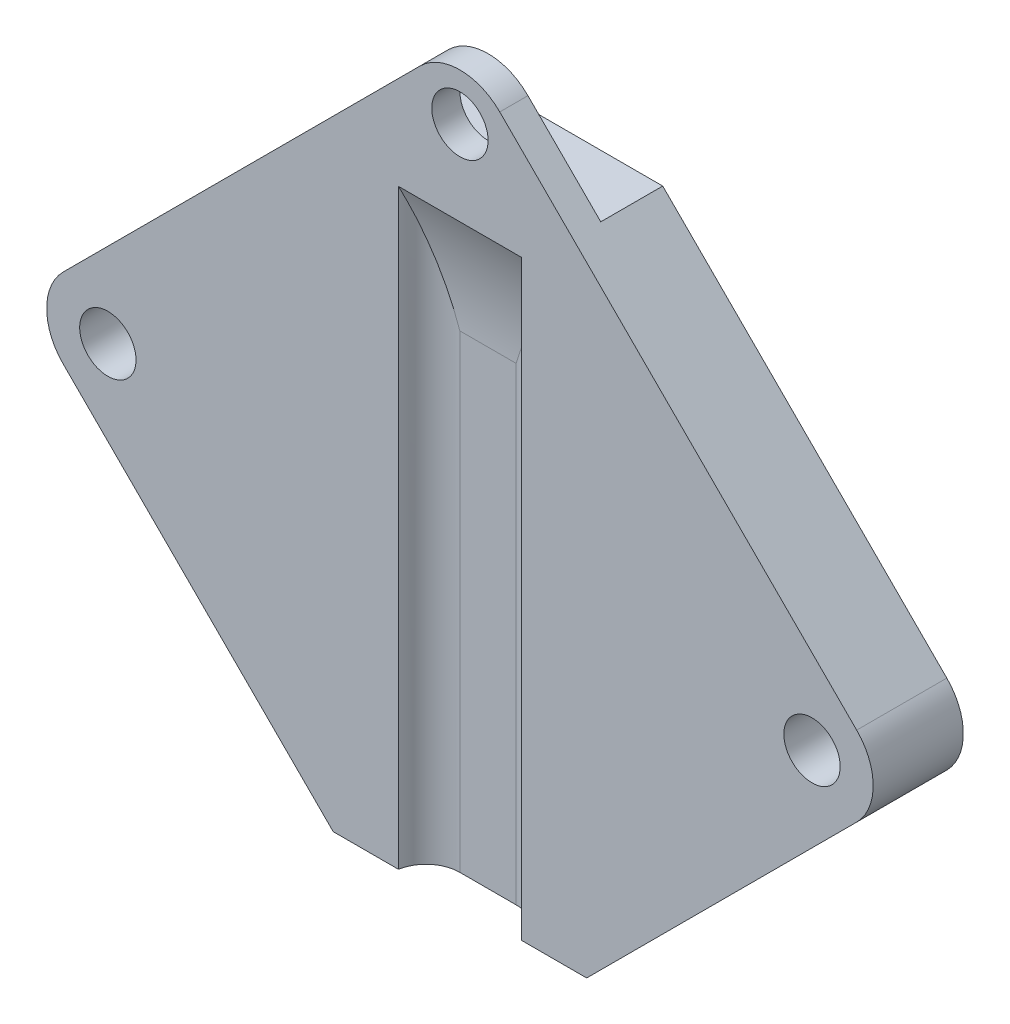
ISO-10303-21;
HEADER;
FILE_DESCRIPTION(('STEP AP214'),'2;1');
FILE_NAME('part.step','',(''),(''),'','','');
FILE_SCHEMA(('AUTOMOTIVE_DESIGN { 1 0 10303 214 1 1 1 1 }'));
ENDSEC;
DATA;
#1=APPLICATION_CONTEXT('core data for automotive mechanical design processes');
#2=APPLICATION_PROTOCOL_DEFINITION('international standard','automotive_design',2000,#1);
#3=PRODUCT_CONTEXT('',#1,'mechanical');
#4=PRODUCT('Part','Part','',(#3));
#5=PRODUCT_RELATED_PRODUCT_CATEGORY('part','',(#4));
#6=PRODUCT_DEFINITION_FORMATION('','',#4);
#7=PRODUCT_DEFINITION_CONTEXT('part definition',#1,'design');
#8=PRODUCT_DEFINITION('design','',#6,#7);
#9=PRODUCT_DEFINITION_SHAPE('','',#8);
#10=(LENGTH_UNIT() NAMED_UNIT(*) SI_UNIT(.MILLI.,.METRE.));
#11=(NAMED_UNIT(*) PLANE_ANGLE_UNIT() SI_UNIT($,.RADIAN.));
#12=(NAMED_UNIT(*) SI_UNIT($,.STERADIAN.) SOLID_ANGLE_UNIT());
#13=UNCERTAINTY_MEASURE_WITH_UNIT(LENGTH_MEASURE(1.E-05),#10,'distance_accuracy_value','');
#14=(GEOMETRIC_REPRESENTATION_CONTEXT(3) GLOBAL_UNCERTAINTY_ASSIGNED_CONTEXT((#13)) GLOBAL_UNIT_ASSIGNED_CONTEXT((#10,
#11,#12)) REPRESENTATION_CONTEXT('',''));
#15=CARTESIAN_POINT('',(0.,0.,0.));
#16=DIRECTION('',(0.,0.,1.));
#17=DIRECTION('',(1.,0.,0.));
#18=AXIS2_PLACEMENT_3D('',#15,#16,#17);
#19=CARTESIAN_POINT('',(-12.1235452370463,-1.24743454438484,3.2));
#20=DIRECTION('',(0.,0.,1.));
#21=DIRECTION('',(1.,0.,0.));
#22=AXIS2_PLACEMENT_3D('',#19,#20,#21);
#23=PLANE('',#22);
#24=DIRECTION('',(0.,-1.,0.));
#25=VECTOR('',#24,1.);
#26=CARTESIAN_POINT('',(-1.634521265384,8.75256545561517,3.2));
#27=LINE('',#26,#25);
#28=CARTESIAN_POINT('',(-1.634521265384,8.75256545561517,3.2));
#29=VERTEX_POINT('',#28);
#30=CARTESIAN_POINT('',(-1.634521265384,-12.2474345443848,3.2));
#31=VERTEX_POINT('',#30);
#32=EDGE_CURVE('E330',#29,#31,#27,.T.);
#33=ORIENTED_EDGE('',*,*,#32,.F.);
#34=DIRECTION('',(1.,0.,0.));
#35=VECTOR('',#34,1.);
#36=CARTESIAN_POINT('',(-12.1235452370463,8.75256545561517,3.2));
#37=LINE('',#36,#35);
#38=CARTESIAN_POINT('',(2.73057654179912,8.75256545561517,3.2));
#39=VERTEX_POINT('',#38);
#40=EDGE_CURVE('E197',#29,#39,#37,.T.);
#41=ORIENTED_EDGE('',*,*,#40,.T.);
#42=DIRECTION('',(0.,-1.,0.));
#43=VECTOR('',#42,1.);
#44=CARTESIAN_POINT('',(2.73057654179912,8.75256545561517,3.2));
#45=LINE('',#44,#43);
#46=CARTESIAN_POINT('',(2.73057654179912,-12.2474345443848,3.2));
#47=VERTEX_POINT('',#46);
#48=EDGE_CURVE('E321',#47,#39,#45,.F.);
#49=ORIENTED_EDGE('',*,*,#48,.F.);
#50=DIRECTION('',(1.,0.,0.));
#51=VECTOR('',#50,1.);
#52=CARTESIAN_POINT('',(-3.95197236179244,-12.2474345443848,3.2));
#53=LINE('',#52,#51);
#54=CARTESIAN_POINT('',(5.04802763820756,-12.2474345443848,3.2));
#55=VERTEX_POINT('',#54);
#56=EDGE_CURVE('E313',#47,#55,#53,.T.);
#57=ORIENTED_EDGE('',*,*,#56,.T.);
#58=DIRECTION('',(0.707106781186547,0.707106781186547,0.));
#59=VECTOR('',#58,1.);
#60=CARTESIAN_POINT('',(5.04802763820756,-12.2474345443848,3.2));
#61=LINE('',#60,#59);
#62=CARTESIAN_POINT('',(14.6338140758345,-2.66164810675793,3.2));
#63=VERTEX_POINT('',#62);
#64=EDGE_CURVE('E298',#55,#63,#61,.T.);
#65=ORIENTED_EDGE('',*,*,#64,.T.);
#66=CARTESIAN_POINT('',(13.2196005134614,-1.24743454438484,3.2));
#67=DIRECTION('',(0.,0.,1.));
#68=DIRECTION('',(1.,0.,0.));
#69=AXIS2_PLACEMENT_3D('',#66,#67,#68);
#70=CIRCLE('',#69,2.);
#71=CARTESIAN_POINT('',(14.6338140758345,0.166779017988258,3.2));
#72=VERTEX_POINT('',#71);
#73=EDGE_CURVE('E296',#63,#72,#70,.T.);
#74=ORIENTED_EDGE('',*,*,#73,.T.);
#75=DIRECTION('',(-0.707106781186548,0.707106781186548,0.));
#76=VECTOR('',#75,1.);
#77=CARTESIAN_POINT('',(14.6338140758345,0.166779017988258,3.2));
#78=LINE('',#77,#76);
#79=CARTESIAN_POINT('',(1.96224120058065,12.8383518932421,3.2));
#80=VERTEX_POINT('',#79);
#81=EDGE_CURVE('E297',#72,#80,#78,.T.);
#82=ORIENTED_EDGE('',*,*,#81,.T.);
#83=CARTESIAN_POINT('',(0.548027638207556,11.424138330869,3.2));
#84=DIRECTION('',(0.,0.,1.));
#85=DIRECTION('',(1.,0.,0.));
#86=AXIS2_PLACEMENT_3D('',#83,#84,#85);
#87=CIRCLE('',#86,2.);
#88=CARTESIAN_POINT('',(-0.866185924165539,12.8383518932421,3.2));
#89=VERTEX_POINT('',#88);
#90=EDGE_CURVE('E300',#80,#89,#87,.T.);
#91=ORIENTED_EDGE('',*,*,#90,.T.);
#92=DIRECTION('',(-0.707106781186548,-0.707106781186548,0.));
#93=VECTOR('',#92,1.);
#94=CARTESIAN_POINT('',(-0.866185924165539,12.8383518932421,3.2));
#95=LINE('',#94,#93);
#96=CARTESIAN_POINT('',(-13.5377587994193,0.166779017988258,3.2));
#97=VERTEX_POINT('',#96);
#98=EDGE_CURVE('E175',#89,#97,#95,.T.);
#99=ORIENTED_EDGE('',*,*,#98,.T.);
#100=CARTESIAN_POINT('',(-12.1235452370463,-1.24743454438484,3.2));
#101=DIRECTION('',(0.,0.,1.));
#102=DIRECTION('',(1.,0.,0.));
#103=AXIS2_PLACEMENT_3D('',#100,#101,#102);
#104=CIRCLE('',#103,2.);
#105=CARTESIAN_POINT('',(-13.5377587994193,-2.66164810675793,3.2));
#106=VERTEX_POINT('',#105);
#107=EDGE_CURVE('E165',#97,#106,#104,.T.);
#108=ORIENTED_EDGE('',*,*,#107,.T.);
#109=DIRECTION('',(0.707106781186548,-0.707106781186548,0.));
#110=VECTOR('',#109,1.);
#111=CARTESIAN_POINT('',(-13.5377587994193,-2.66164810675793,3.2));
#112=LINE('',#111,#110);
#113=CARTESIAN_POINT('',(-3.95197236179244,-12.2474345443848,3.2));
#114=VERTEX_POINT('',#113);
#115=EDGE_CURVE('E311',#106,#114,#112,.T.);
#116=ORIENTED_EDGE('',*,*,#115,.T.);
#117=EDGE_CURVE('E302',#114,#31,#53,.T.);
#118=ORIENTED_EDGE('',*,*,#117,.T.);
#119=EDGE_LOOP('',(#33,#41,#49,#57,#65,#74,#82,#91,#99,#108,#116,#118));
#120=FACE_BOUND('',#119,.T.);
#121=CARTESIAN_POINT('',(13.0480276382076,-1.24743454438484,3.2));
#122=DIRECTION('',(0.,0.,1.));
#123=DIRECTION('',(1.,0.,0.));
#124=AXIS2_PLACEMENT_3D('',#121,#122,#123);
#125=CIRCLE('',#124,1.);
#126=CARTESIAN_POINT('',(14.0480276382076,-1.24743454438484,3.2));
#127=VERTEX_POINT('',#126);
#128=EDGE_CURVE('E341',#127,#127,#125,.T.);
#129=ORIENTED_EDGE('',*,*,#128,.F.);
#130=EDGE_LOOP('',(#129));
#131=FACE_BOUND('',#130,.T.);
#132=CARTESIAN_POINT('',(-11.9519723617924,-1.24743454438484,3.2));
#133=DIRECTION('',(0.,0.,1.));
#134=DIRECTION('',(1.,0.,0.));
#135=AXIS2_PLACEMENT_3D('',#132,#133,#134);
#136=CIRCLE('',#135,1.);
#137=CARTESIAN_POINT('',(-10.9519723617924,-1.24743454438484,3.2));
#138=VERTEX_POINT('',#137);
#139=EDGE_CURVE('E280',#138,#138,#136,.T.);
#140=ORIENTED_EDGE('',*,*,#139,.F.);
#141=EDGE_LOOP('',(#140));
#142=FACE_BOUND('',#141,.T.);
#143=CARTESIAN_POINT('',(0.548027638207556,11.7525654556152,3.2));
#144=DIRECTION('',(0.,0.,1.));
#145=DIRECTION('',(1.,0.,0.));
#146=AXIS2_PLACEMENT_3D('',#143,#144,#145);
#147=CIRCLE('',#146,1.);
#148=CARTESIAN_POINT('',(1.54802763820756,11.7525654556152,3.2));
#149=VERTEX_POINT('',#148);
#150=EDGE_CURVE('E332',#149,#149,#147,.T.);
#151=ORIENTED_EDGE('',*,*,#150,.F.);
#152=EDGE_LOOP('',(#151));
#153=FACE_BOUND('',#152,.T.);
#154=ADVANCED_FACE('F37',(#120,#131,#142,#153),#23,.T.);
#155=CARTESIAN_POINT('',(-12.1235452370463,-1.24743454438484,0.));
#156=DIRECTION('',(0.,0.,1.));
#157=DIRECTION('',(1.,0.,0.));
#158=AXIS2_PLACEMENT_3D('',#155,#156,#157);
#159=PLANE('',#158);
#160=DIRECTION('',(-0.707106781186548,-0.707106781186548,0.));
#161=VECTOR('',#160,1.);
#162=CARTESIAN_POINT('',(-0.866185924165539,12.8383518932421,0.));
#163=LINE('',#162,#161);
#164=CARTESIAN_POINT('',(-3.45197236179244,10.2525654556152,0.));
#165=VERTEX_POINT('',#164);
#166=CARTESIAN_POINT('',(-13.5377587994193,0.166779017988258,0.));
#167=VERTEX_POINT('',#166);
#168=EDGE_CURVE('E155',#165,#167,#163,.T.);
#169=ORIENTED_EDGE('',*,*,#168,.F.);
#170=DIRECTION('',(-1.,0.,0.));
#171=VECTOR('',#170,1.);
#172=CARTESIAN_POINT('',(4.54802763820756,10.2525654556152,0.));
#173=LINE('',#172,#171);
#174=CARTESIAN_POINT('',(4.54802763820756,10.2525654556152,0.));
#175=VERTEX_POINT('',#174);
#176=EDGE_CURVE('E54',#175,#165,#173,.T.);
#177=ORIENTED_EDGE('',*,*,#176,.F.);
#178=DIRECTION('',(-0.707106781186548,0.707106781186548,0.));
#179=VECTOR('',#178,1.);
#180=CARTESIAN_POINT('',(14.6338140758345,0.166779017988258,0.));
#181=LINE('',#180,#179);
#182=CARTESIAN_POINT('',(14.6338140758345,0.166779017988258,0.));
#183=VERTEX_POINT('',#182);
#184=EDGE_CURVE('E153',#183,#175,#181,.T.);
#185=ORIENTED_EDGE('',*,*,#184,.F.);
#186=CARTESIAN_POINT('',(13.2196005134614,-1.24743454438484,0.));
#187=DIRECTION('',(0.,0.,1.));
#188=DIRECTION('',(1.,0.,0.));
#189=AXIS2_PLACEMENT_3D('',#186,#187,#188);
#190=CIRCLE('',#189,2.);
#191=CARTESIAN_POINT('',(14.6338140758345,-2.66164810675793,0.));
#192=VERTEX_POINT('',#191);
#193=EDGE_CURVE('E163',#192,#183,#190,.T.);
#194=ORIENTED_EDGE('',*,*,#193,.F.);
#195=DIRECTION('',(0.707106781186547,0.707106781186547,0.));
#196=VECTOR('',#195,1.);
#197=CARTESIAN_POINT('',(5.04802763820756,-12.2474345443848,0.));
#198=LINE('',#197,#196);
#199=CARTESIAN_POINT('',(5.04802763820756,-12.2474345443848,0.));
#200=VERTEX_POINT('',#199);
#201=EDGE_CURVE('E167',#200,#192,#198,.T.);
#202=ORIENTED_EDGE('',*,*,#201,.F.);
#203=DIRECTION('',(1.,0.,0.));
#204=VECTOR('',#203,1.);
#205=CARTESIAN_POINT('',(-3.95197236179244,-12.2474345443848,0.));
#206=LINE('',#205,#204);
#207=CARTESIAN_POINT('',(-3.95197236179244,-12.2474345443848,0.));
#208=VERTEX_POINT('',#207);
#209=EDGE_CURVE('E282',#208,#200,#206,.T.);
#210=ORIENTED_EDGE('',*,*,#209,.F.);
#211=DIRECTION('',(0.707106781186548,-0.707106781186548,0.));
#212=VECTOR('',#211,1.);
#213=CARTESIAN_POINT('',(-13.5377587994193,-2.66164810675793,0.));
#214=LINE('',#213,#212);
#215=CARTESIAN_POINT('',(-13.5377587994193,-2.66164810675793,0.));
#216=VERTEX_POINT('',#215);
#217=EDGE_CURVE('E279',#216,#208,#214,.T.);
#218=ORIENTED_EDGE('',*,*,#217,.F.);
#219=CARTESIAN_POINT('',(-12.1235452370463,-1.24743454438484,0.));
#220=DIRECTION('',(0.,0.,1.));
#221=DIRECTION('',(1.,0.,0.));
#222=AXIS2_PLACEMENT_3D('',#219,#220,#221);
#223=CIRCLE('',#222,2.);
#224=EDGE_CURVE('E276',#167,#216,#223,.T.);
#225=ORIENTED_EDGE('',*,*,#224,.F.);
#226=EDGE_LOOP('',(#169,#177,#185,#194,#202,#210,#218,#225));
#227=FACE_BOUND('',#226,.T.);
#228=CARTESIAN_POINT('',(-11.9519723617924,-1.24743454438484,0.));
#229=DIRECTION('',(0.,0.,1.));
#230=DIRECTION('',(1.,0.,0.));
#231=AXIS2_PLACEMENT_3D('',#228,#229,#230);
#232=CIRCLE('',#231,1.);
#233=CARTESIAN_POINT('',(-10.9519723617924,-1.24743454438484,0.));
#234=VERTEX_POINT('',#233);
#235=EDGE_CURVE('E285',#234,#234,#232,.T.);
#236=ORIENTED_EDGE('',*,*,#235,.T.);
#237=EDGE_LOOP('',(#236));
#238=FACE_BOUND('',#237,.T.);
#239=CARTESIAN_POINT('',(13.0480276382076,-1.24743454438484,0.));
#240=DIRECTION('',(0.,0.,1.));
#241=DIRECTION('',(1.,0.,0.));
#242=AXIS2_PLACEMENT_3D('',#239,#240,#241);
#243=CIRCLE('',#242,1.);
#244=CARTESIAN_POINT('',(14.0480276382076,-1.24743454438484,0.));
#245=VERTEX_POINT('',#244);
#246=EDGE_CURVE('E335',#245,#245,#243,.T.);
#247=ORIENTED_EDGE('',*,*,#246,.T.);
#248=EDGE_LOOP('',(#247));
#249=FACE_BOUND('',#248,.T.);
#250=ADVANCED_FACE('F150',(#227,#238,#249),#159,.F.);
#251=CARTESIAN_POINT('',(-12.1235452370463,-1.24743454438484,3.2));
#252=DIRECTION('',(0.,0.,-1.));
#253=DIRECTION('',(-1.,0.,0.));
#254=AXIS2_PLACEMENT_3D('',#251,#252,#253);
#255=CYLINDRICAL_SURFACE('',#254,2.);
#256=ORIENTED_EDGE('',*,*,#224,.T.);
#257=DIRECTION('',(0.,0.,-1.));
#258=VECTOR('',#257,1.);
#259=CARTESIAN_POINT('',(-13.5377587994193,-2.66164810675793,3.2));
#260=LINE('',#259,#258);
#261=EDGE_CURVE('E191',#106,#216,#260,.T.);
#262=ORIENTED_EDGE('',*,*,#261,.F.);
#263=ORIENTED_EDGE('',*,*,#107,.F.);
#264=DIRECTION('',(0.,0.,-1.));
#265=VECTOR('',#264,1.);
#266=CARTESIAN_POINT('',(-13.5377587994193,0.166779017988258,3.2));
#267=LINE('',#266,#265);
#268=EDGE_CURVE('E171',#97,#167,#267,.T.);
#269=ORIENTED_EDGE('',*,*,#268,.T.);
#270=EDGE_LOOP('',(#256,#262,#263,#269));
#271=FACE_BOUND('',#270,.T.);
#272=ADVANCED_FACE('F245',(#271),#255,.T.);
#273=CARTESIAN_POINT('',(-13.5377587994193,-2.66164810675793,3.2));
#274=DIRECTION('',(0.707106781186548,0.707106781186548,0.));
#275=DIRECTION('',(-0.707106781186548,0.707106781186548,0.));
#276=AXIS2_PLACEMENT_3D('',#273,#274,#275);
#277=PLANE('',#276);
#278=ORIENTED_EDGE('',*,*,#217,.T.);
#279=DIRECTION('',(0.,0.,-1.));
#280=VECTOR('',#279,1.);
#281=CARTESIAN_POINT('',(-3.95197236179244,-12.2474345443848,3.2));
#282=LINE('',#281,#280);
#283=EDGE_CURVE('E188',#114,#208,#282,.T.);
#284=ORIENTED_EDGE('',*,*,#283,.F.);
#285=ORIENTED_EDGE('',*,*,#115,.F.);
#286=ORIENTED_EDGE('',*,*,#261,.T.);
#287=EDGE_LOOP('',(#278,#284,#285,#286));
#288=FACE_BOUND('',#287,.T.);
#289=ADVANCED_FACE('F266',(#288),#277,.F.);
#290=CARTESIAN_POINT('',(-3.95197236179244,-12.2474345443848,3.2));
#291=DIRECTION('',(0.,1.,0.));
#292=DIRECTION('',(0.,0.,1.));
#293=AXIS2_PLACEMENT_3D('',#290,#291,#292);
#294=PLANE('',#293);
#295=DIRECTION('',(1.,0.,0.));
#296=VECTOR('',#295,1.);
#297=CARTESIAN_POINT('',(-0.451972361792444,-12.2474345443848,2.20390706366971));
#298=LINE('',#297,#296);
#299=CARTESIAN_POINT('',(-0.451972361792444,-12.2474345443848,2.20390706366971));
#300=VERTEX_POINT('',#299);
#301=CARTESIAN_POINT('',(1.54802763820756,-12.2474345443848,2.20390706366971));
#302=VERTEX_POINT('',#301);
#303=EDGE_CURVE('E327',#300,#302,#298,.T.);
#304=ORIENTED_EDGE('',*,*,#303,.F.);
#305=CARTESIAN_POINT('',(-0.451972361792444,-12.2474345443848,3.40390706366971));
#306=DIRECTION('',(0.,1.,0.));
#307=DIRECTION('',(0.,0.,1.));
#308=AXIS2_PLACEMENT_3D('',#305,#306,#307);
#309=CIRCLE('',#308,1.2);
#310=EDGE_CURVE('E194',#300,#31,#309,.T.);
#311=ORIENTED_EDGE('',*,*,#310,.T.);
#312=ORIENTED_EDGE('',*,*,#117,.F.);
#313=ORIENTED_EDGE('',*,*,#283,.T.);
#314=ORIENTED_EDGE('',*,*,#209,.T.);
#315=DIRECTION('',(0.,0.,-1.));
#316=VECTOR('',#315,1.);
#317=CARTESIAN_POINT('',(5.04802763820756,-12.2474345443848,3.2));
#318=LINE('',#317,#316);
#319=EDGE_CURVE('E185',#55,#200,#318,.T.);
#320=ORIENTED_EDGE('',*,*,#319,.F.);
#321=ORIENTED_EDGE('',*,*,#56,.F.);
#322=CARTESIAN_POINT('',(1.54802763820756,-12.2474345443848,3.40390706366971));
#323=DIRECTION('',(0.,-1.,0.));
#324=DIRECTION('',(0.,0.,-1.));
#325=AXIS2_PLACEMENT_3D('',#322,#323,#324);
#326=CIRCLE('',#325,1.2);
#327=EDGE_CURVE('E358',#302,#47,#326,.T.);
#328=ORIENTED_EDGE('',*,*,#327,.F.);
#329=EDGE_LOOP('',(#304,#311,#312,#313,#314,#320,#321,#328));
#330=FACE_BOUND('',#329,.T.);
#331=ADVANCED_FACE('F262',(#330),#294,.F.);
#332=CARTESIAN_POINT('',(5.04802763820756,-12.2474345443848,3.2));
#333=DIRECTION('',(-0.707106781186548,0.707106781186548,0.));
#334=DIRECTION('',(-0.707106781186548,-0.707106781186548,0.));
#335=AXIS2_PLACEMENT_3D('',#332,#333,#334);
#336=PLANE('',#335);
#337=ORIENTED_EDGE('',*,*,#201,.T.);
#338=DIRECTION('',(0.,0.,-1.));
#339=VECTOR('',#338,1.);
#340=CARTESIAN_POINT('',(14.6338140758345,-2.66164810675793,3.2));
#341=LINE('',#340,#339);
#342=EDGE_CURVE('E182',#63,#192,#341,.T.);
#343=ORIENTED_EDGE('',*,*,#342,.F.);
#344=ORIENTED_EDGE('',*,*,#64,.F.);
#345=ORIENTED_EDGE('',*,*,#319,.T.);
#346=EDGE_LOOP('',(#337,#343,#344,#345));
#347=FACE_BOUND('',#346,.T.);
#348=ADVANCED_FACE('F258',(#347),#336,.F.);
#349=CARTESIAN_POINT('',(13.2196005134614,-1.24743454438484,3.2));
#350=DIRECTION('',(0.,0.,-1.));
#351=DIRECTION('',(-1.,0.,0.));
#352=AXIS2_PLACEMENT_3D('',#349,#350,#351);
#353=CYLINDRICAL_SURFACE('',#352,2.);
#354=ORIENTED_EDGE('',*,*,#193,.T.);
#355=DIRECTION('',(0.,0.,-1.));
#356=VECTOR('',#355,1.);
#357=CARTESIAN_POINT('',(14.6338140758345,0.166779017988258,3.2));
#358=LINE('',#357,#356);
#359=EDGE_CURVE('E162',#72,#183,#358,.T.);
#360=ORIENTED_EDGE('',*,*,#359,.F.);
#361=ORIENTED_EDGE('',*,*,#73,.F.);
#362=ORIENTED_EDGE('',*,*,#342,.T.);
#363=EDGE_LOOP('',(#354,#360,#361,#362));
#364=FACE_BOUND('',#363,.T.);
#365=ADVANCED_FACE('F255',(#364),#353,.T.);
#366=CARTESIAN_POINT('',(14.6338140758345,0.166779017988258,3.2));
#367=DIRECTION('',(-0.707106781186548,-0.707106781186548,0.));
#368=DIRECTION('',(0.707106781186548,-0.707106781186548,0.));
#369=AXIS2_PLACEMENT_3D('',#366,#367,#368);
#370=PLANE('',#369);
#371=DIRECTION('',(0.,0.,-1.));
#372=VECTOR('',#371,1.);
#373=CARTESIAN_POINT('',(4.54802763820756,10.2525654556152,12.1442719099992));
#374=LINE('',#373,#372);
#375=CARTESIAN_POINT('',(4.54802763820756,10.2525654556152,2.2));
#376=VERTEX_POINT('',#375);
#377=EDGE_CURVE('E139',#376,#175,#374,.T.);
#378=ORIENTED_EDGE('',*,*,#377,.F.);
#379=DIRECTION('',(0.707106781186548,-0.707106781186548,0.));
#380=VECTOR('',#379,1.);
#381=CARTESIAN_POINT('',(4.54802763820756,10.2525654556152,2.2));
#382=LINE('',#381,#380);
#383=CARTESIAN_POINT('',(1.96224120058065,12.8383518932421,2.2));
#384=VERTEX_POINT('',#383);
#385=EDGE_CURVE('E145',#384,#376,#382,.T.);
#386=ORIENTED_EDGE('',*,*,#385,.F.);
#387=DIRECTION('',(0.,0.,-1.));
#388=VECTOR('',#387,1.);
#389=CARTESIAN_POINT('',(1.96224120058065,12.8383518932421,3.2));
#390=LINE('',#389,#388);
#391=EDGE_CURVE('E178',#80,#384,#390,.T.);
#392=ORIENTED_EDGE('',*,*,#391,.F.);
#393=ORIENTED_EDGE('',*,*,#81,.F.);
#394=ORIENTED_EDGE('',*,*,#359,.T.);
#395=ORIENTED_EDGE('',*,*,#184,.T.);
#396=EDGE_LOOP('',(#378,#386,#392,#393,#394,#395));
#397=FACE_BOUND('',#396,.T.);
#398=ADVANCED_FACE('F159',(#397),#370,.F.);
#399=CARTESIAN_POINT('',(0.548027638207556,11.424138330869,3.2));
#400=DIRECTION('',(0.,0.,-1.));
#401=DIRECTION('',(-1.,0.,0.));
#402=AXIS2_PLACEMENT_3D('',#399,#400,#401);
#403=CYLINDRICAL_SURFACE('',#402,2.);
#404=ORIENTED_EDGE('',*,*,#391,.T.);
#405=CARTESIAN_POINT('',(0.548027638207556,11.424138330869,2.2));
#406=DIRECTION('',(0.,0.,1.));
#407=DIRECTION('',(1.,0.,0.));
#408=AXIS2_PLACEMENT_3D('',#405,#406,#407);
#409=CIRCLE('',#408,2.);
#410=CARTESIAN_POINT('',(-0.866185924165539,12.8383518932421,2.2));
#411=VERTEX_POINT('',#410);
#412=EDGE_CURVE('E362',#384,#411,#409,.T.);
#413=ORIENTED_EDGE('',*,*,#412,.T.);
#414=DIRECTION('',(0.,0.,-1.));
#415=VECTOR('',#414,1.);
#416=CARTESIAN_POINT('',(-0.866185924165539,12.8383518932421,3.2));
#417=LINE('',#416,#415);
#418=EDGE_CURVE('E174',#89,#411,#417,.T.);
#419=ORIENTED_EDGE('',*,*,#418,.F.);
#420=ORIENTED_EDGE('',*,*,#90,.F.);
#421=EDGE_LOOP('',(#404,#413,#419,#420));
#422=FACE_BOUND('',#421,.T.);
#423=ADVANCED_FACE('F248',(#422),#403,.T.);
#424=CARTESIAN_POINT('',(-0.866185924165539,12.8383518932421,3.2));
#425=DIRECTION('',(0.707106781186548,-0.707106781186548,0.));
#426=DIRECTION('',(0.707106781186547,0.707106781186548,0.));
#427=AXIS2_PLACEMENT_3D('',#424,#425,#426);
#428=PLANE('',#427);
#429=ORIENTED_EDGE('',*,*,#418,.T.);
#430=DIRECTION('',(0.707106781186548,0.707106781186548,0.));
#431=VECTOR('',#430,1.);
#432=CARTESIAN_POINT('',(0.548027638207556,14.2525654556152,2.2));
#433=LINE('',#432,#431);
#434=CARTESIAN_POINT('',(-3.45197236179244,10.2525654556152,2.2));
#435=VERTEX_POINT('',#434);
#436=EDGE_CURVE('E156',#435,#411,#433,.T.);
#437=ORIENTED_EDGE('',*,*,#436,.F.);
#438=DIRECTION('',(0.,0.,-1.));
#439=VECTOR('',#438,1.);
#440=CARTESIAN_POINT('',(-3.45197236179244,10.2525654556152,12.1442719099992));
#441=LINE('',#440,#439);
#442=EDGE_CURVE('E365',#435,#165,#441,.T.);
#443=ORIENTED_EDGE('',*,*,#442,.T.);
#444=ORIENTED_EDGE('',*,*,#168,.T.);
#445=ORIENTED_EDGE('',*,*,#268,.F.);
#446=ORIENTED_EDGE('',*,*,#98,.F.);
#447=EDGE_LOOP('',(#429,#437,#443,#444,#445,#446));
#448=FACE_BOUND('',#447,.T.);
#449=ADVANCED_FACE('F238',(#448),#428,.F.);
#450=CARTESIAN_POINT('',(-11.9519723617924,-1.24743454438484,3.2));
#451=DIRECTION('',(0.,0.,-1.));
#452=DIRECTION('',(-1.,0.,0.));
#453=AXIS2_PLACEMENT_3D('',#450,#451,#452);
#454=CYLINDRICAL_SURFACE('',#453,1.);
#455=ORIENTED_EDGE('',*,*,#139,.T.);
#456=EDGE_LOOP('',(#455));
#457=FACE_BOUND('',#456,.T.);
#458=ORIENTED_EDGE('',*,*,#235,.F.);
#459=EDGE_LOOP('',(#458));
#460=FACE_BOUND('',#459,.T.);
#461=ADVANCED_FACE('F234',(#457,#460),#454,.F.);
#462=CARTESIAN_POINT('',(13.0480276382076,-1.24743454438484,3.2));
#463=DIRECTION('',(0.,0.,-1.));
#464=DIRECTION('',(-1.,0.,0.));
#465=AXIS2_PLACEMENT_3D('',#462,#463,#464);
#466=CYLINDRICAL_SURFACE('',#465,1.);
#467=ORIENTED_EDGE('',*,*,#128,.T.);
#468=EDGE_LOOP('',(#467));
#469=FACE_BOUND('',#468,.T.);
#470=ORIENTED_EDGE('',*,*,#246,.F.);
#471=EDGE_LOOP('',(#470));
#472=FACE_BOUND('',#471,.T.);
#473=ADVANCED_FACE('F230',(#469,#472),#466,.F.);
#474=CARTESIAN_POINT('',(0.548027638207556,11.7525654556152,3.2));
#475=DIRECTION('',(0.,0.,-1.));
#476=DIRECTION('',(-1.,0.,0.));
#477=AXIS2_PLACEMENT_3D('',#474,#475,#476);
#478=CYLINDRICAL_SURFACE('',#477,1.);
#479=CARTESIAN_POINT('',(0.548027638207556,11.7525654556152,2.2));
#480=DIRECTION('',(0.,0.,1.));
#481=DIRECTION('',(1.,0.,0.));
#482=AXIS2_PLACEMENT_3D('',#479,#480,#481);
#483=CIRCLE('',#482,1.);
#484=CARTESIAN_POINT('',(1.54802763820756,11.7525654556152,2.2));
#485=VERTEX_POINT('',#484);
#486=EDGE_CURVE('E42',#485,#485,#483,.T.);
#487=ORIENTED_EDGE('',*,*,#486,.F.);
#488=EDGE_LOOP('',(#487));
#489=FACE_BOUND('',#488,.T.);
#490=ORIENTED_EDGE('',*,*,#150,.T.);
#491=EDGE_LOOP('',(#490));
#492=FACE_BOUND('',#491,.T.);
#493=ADVANCED_FACE('F222',(#489,#492),#478,.F.);
#494=CARTESIAN_POINT('',(-0.451972361792444,8.75256545561517,3.40390706366971));
#495=DIRECTION('',(0.,-1.,0.));
#496=DIRECTION('',(0.,0.,-1.));
#497=AXIS2_PLACEMENT_3D('',#494,#495,#496);
#498=CYLINDRICAL_SURFACE('',#497,1.2);
#499=DIRECTION('',(0.,-1.,0.));
#500=VECTOR('',#499,1.);
#501=CARTESIAN_POINT('',(-0.451972361792444,8.75256545561517,2.20390706366971));
#502=LINE('',#501,#500);
#503=CARTESIAN_POINT('',(-0.451972361792444,4.40174282204358,2.20390706366971));
#504=VERTEX_POINT('',#503);
#505=EDGE_CURVE('E328',#504,#300,#502,.T.);
#506=ORIENTED_EDGE('',*,*,#505,.F.);
#507=CARTESIAN_POINT('',(-1.634521265384,8.75256545561517,3.2));
#508=CARTESIAN_POINT('',(-1.62742166854424,8.66753352133177,3.15890959047029));
#509=CARTESIAN_POINT('',(-1.61836685713988,8.58206895848201,3.1190992909149));
#510=CARTESIAN_POINT('',(-1.59682368385973,8.41044247975531,3.0420752403015));
#511=CARTESIAN_POINT('',(-1.58433664425129,8.32428084480729,3.00486049621283));
#512=CARTESIAN_POINT('',(-1.55642340567842,8.15150920365221,2.93309317841487));
#513=CARTESIAN_POINT('',(-1.54100223006989,8.06490020637132,2.89853619447813));
#514=CARTESIAN_POINT('',(-1.50758525001569,7.89118223329485,2.83200942056852));
#515=CARTESIAN_POINT('',(-1.48958915966445,7.80407320301048,2.8000399185146));
#516=CARTESIAN_POINT('',(-1.43239402505051,7.54278279988989,2.70823100518636));
#517=CARTESIAN_POINT('',(-1.38987459836444,7.36796806652128,2.65221361250332));
#518=CARTESIAN_POINT('',(-1.29812085445788,7.01712661622551,2.55024603847703));
#519=CARTESIAN_POINT('',(-1.24888327719699,6.84109935052721,2.50430077311035));
#520=CARTESIAN_POINT('',(-1.14262982250453,6.47876325030847,2.42012473149362));
#521=CARTESIAN_POINT('',(-1.0853386548961,6.29240846356877,2.38243859705619));
#522=CARTESIAN_POINT('',(-0.966838082836076,5.91906461350071,2.31787387045225));
#523=CARTESIAN_POINT('',(-0.905627428473529,5.73207536602897,2.29099874597698));
#524=CARTESIAN_POINT('',(-0.718290589109998,5.17065996766195,2.22640230921254));
#525=CARTESIAN_POINT('',(-0.588356540865859,4.79545204665018,2.20463303629294));
#526=CARTESIAN_POINT('',(-0.456336671420218,4.4143415278263,2.20391301940083));
#527=CARTESIAN_POINT('',(-0.454154490704055,4.40804211545445,2.2039070673601));
#528=CARTESIAN_POINT('',(-0.451972361792444,4.40174282204358,2.2039070636697));
#529=B_SPLINE_CURVE_WITH_KNOTS('',3,(#507,#508,#509,#510,#511,#512,#513,#514,#515,#516,#517,
#518,#519,#520,#521,#522,#523,#524,#525,#526,#527,#528),.UNSPECIFIED.,.F.,.F.,(4,2,2,2,2,2,2,2,
2,2,4),(0.,0.284058860323902,0.568008439866837,0.851476191050468,1.13497544152665,
1.69977715062909,2.26485391587896,2.86018062018945,3.45569812686292,4.64566458840564,
4.66566459637763),.UNSPECIFIED.);
#530=EDGE_CURVE('E12',#504,#29,#529,.F.);
#531=ORIENTED_EDGE('',*,*,#530,.T.);
#532=ORIENTED_EDGE('',*,*,#32,.T.);
#533=ORIENTED_EDGE('',*,*,#310,.F.);
#534=EDGE_LOOP('',(#506,#531,#532,#533));
#535=FACE_BOUND('',#534,.T.);
#536=ADVANCED_FACE('F213',(#535),#498,.F.);
#537=CARTESIAN_POINT('',(1.54802763820756,8.75256545561517,3.40390706366971));
#538=DIRECTION('',(0.,-1.,0.));
#539=DIRECTION('',(0.,0.,-1.));
#540=AXIS2_PLACEMENT_3D('',#537,#538,#539);
#541=CYLINDRICAL_SURFACE('',#540,1.2);
#542=ORIENTED_EDGE('',*,*,#48,.T.);
#543=CARTESIAN_POINT('',(2.73057654179912,8.75256545561517,3.2));
#544=CARTESIAN_POINT('',(2.72347694495935,8.66753352133174,3.15890959047028));
#545=CARTESIAN_POINT('',(2.71442213355499,8.58206895848197,3.11909929091488));
#546=CARTESIAN_POINT('',(2.69287896027483,8.41044247975523,3.04207524030147));
#547=CARTESIAN_POINT('',(2.68039192066638,8.32428084480719,3.00486049621279));
#548=CARTESIAN_POINT('',(2.65247868209351,8.15150920365207,2.93309317841482));
#549=CARTESIAN_POINT('',(2.63705750648498,8.06490020637117,2.89853619447807));
#550=CARTESIAN_POINT('',(2.60364052643077,7.89118223329467,2.83200942056845));
#551=CARTESIAN_POINT('',(2.58564443607952,7.80407320301028,2.80003991851453));
#552=CARTESIAN_POINT('',(2.52844930146558,7.54278279988971,2.7082310051863));
#553=CARTESIAN_POINT('',(2.48592987477951,7.36796806652113,2.65221361250327));
#554=CARTESIAN_POINT('',(2.39417613087297,7.01712661622544,2.55024603847701));
#555=CARTESIAN_POINT('',(2.3449385536121,6.84109935052717,2.50430077311035));
#556=CARTESIAN_POINT('',(2.23868509891963,6.47876325030848,2.42012473149362));
#557=CARTESIAN_POINT('',(2.18139393131116,6.2924084635688,2.38243859705619));
#558=CARTESIAN_POINT('',(2.06289335925124,5.91906461350071,2.31787387045226));
#559=CARTESIAN_POINT('',(2.00168270488884,5.73207536602893,2.29099874597699));
#560=CARTESIAN_POINT('',(1.81434586552473,5.17065996766211,2.22640230921254));
#561=CARTESIAN_POINT('',(1.68441181727886,4.79545204665093,2.20463303629292));
#562=CARTESIAN_POINT('',(1.55239194783526,4.41434152782633,2.20391301940083));
#563=CARTESIAN_POINT('',(1.55020976711913,4.40804211545446,2.2039070673601));
#564=CARTESIAN_POINT('',(1.54802763820756,4.40174282204358,2.20390706366971));
#565=B_SPLINE_CURVE_WITH_KNOTS('',3,(#543,#544,#545,#546,#547,#548,#549,#550,#551,#552,#553,
#554,#555,#556,#557,#558,#559,#560,#561,#562,#563,#564),.UNSPECIFIED.,.F.,.F.,(4,2,2,2,2,2,2,2,
2,2,4),(0.,0.284058860323968,0.568008439866968,0.851476191050651,1.13497544152689,
1.6997771506292,2.26485391587896,2.86018062018944,3.45569812686289,4.64566458840563,
4.66566459637763),.UNSPECIFIED.);
#566=CARTESIAN_POINT('',(1.54802763820756,4.40174282204358,2.20390706366971));
#567=VERTEX_POINT('',#566);
#568=EDGE_CURVE('E200',#39,#567,#565,.T.);
#569=ORIENTED_EDGE('',*,*,#568,.T.);
#570=DIRECTION('',(0.,-1.,0.));
#571=VECTOR('',#570,1.);
#572=CARTESIAN_POINT('',(1.54802763820756,8.75256545561517,2.20390706366971));
#573=LINE('',#572,#571);
#574=EDGE_CURVE('E337',#567,#302,#573,.T.);
#575=ORIENTED_EDGE('',*,*,#574,.T.);
#576=ORIENTED_EDGE('',*,*,#327,.T.);
#577=EDGE_LOOP('',(#542,#569,#575,#576));
#578=FACE_BOUND('',#577,.T.);
#579=ADVANCED_FACE('F207',(#578),#541,.F.);
#580=CARTESIAN_POINT('',(-0.451972361792444,8.75256545561517,2.20390706366971));
#581=DIRECTION('',(0.,0.,-1.));
#582=DIRECTION('',(-1.,0.,0.));
#583=AXIS2_PLACEMENT_3D('',#580,#581,#582);
#584=PLANE('',#583);
#585=ORIENTED_EDGE('',*,*,#574,.F.);
#586=DIRECTION('',(-1.,0.,0.));
#587=VECTOR('',#586,1.);
#588=CARTESIAN_POINT('',(-0.451972361792444,4.40174282204358,2.20390706366971));
#589=LINE('',#588,#587);
#590=EDGE_CURVE('E47',#567,#504,#589,.T.);
#591=ORIENTED_EDGE('',*,*,#590,.T.);
#592=ORIENTED_EDGE('',*,*,#505,.T.);
#593=ORIENTED_EDGE('',*,*,#303,.T.);
#594=EDGE_LOOP('',(#585,#591,#592,#593));
#595=FACE_BOUND('',#594,.T.);
#596=ADVANCED_FACE('F212',(#595),#584,.F.);
#597=CARTESIAN_POINT('',(-0.451972361792446,4.40174282204358,12.2039070636697));
#598=DIRECTION('',(-1.,0.,0.));
#599=DIRECTION('',(0.,0.,1.));
#600=AXIS2_PLACEMENT_3D('',#597,#598,#599);
#601=CYLINDRICAL_SURFACE('',#600,10.);
#602=ORIENTED_EDGE('',*,*,#530,.F.);
#603=ORIENTED_EDGE('',*,*,#590,.F.);
#604=ORIENTED_EDGE('',*,*,#568,.F.);
#605=ORIENTED_EDGE('',*,*,#40,.F.);
#606=EDGE_LOOP('',(#602,#603,#604,#605));
#607=FACE_BOUND('',#606,.T.);
#608=ADVANCED_FACE('F39',(#607),#601,.F.);
#609=CARTESIAN_POINT('',(-12.1235452370463,-1.24743454438484,2.2));
#610=DIRECTION('',(0.,0.,1.));
#611=DIRECTION('',(1.,0.,0.));
#612=AXIS2_PLACEMENT_3D('',#609,#610,#611);
#613=PLANE('',#612);
#614=ORIENTED_EDGE('',*,*,#486,.T.);
#615=EDGE_LOOP('',(#614));
#616=FACE_BOUND('',#615,.T.);
#617=ORIENTED_EDGE('',*,*,#385,.T.);
#618=DIRECTION('',(-1.,0.,0.));
#619=VECTOR('',#618,1.);
#620=CARTESIAN_POINT('',(4.54802763820756,10.2525654556152,2.2));
#621=LINE('',#620,#619);
#622=EDGE_CURVE('E141',#376,#435,#621,.T.);
#623=ORIENTED_EDGE('',*,*,#622,.T.);
#624=ORIENTED_EDGE('',*,*,#436,.T.);
#625=ORIENTED_EDGE('',*,*,#412,.F.);
#626=EDGE_LOOP('',(#617,#623,#624,#625));
#627=FACE_BOUND('',#626,.T.);
#628=ADVANCED_FACE('F215',(#616,#627),#613,.F.);
#629=CARTESIAN_POINT('',(4.54802763820756,10.2525654556152,12.1442719099992));
#630=DIRECTION('',(0.,-1.,0.));
#631=DIRECTION('',(0.,0.,-1.));
#632=AXIS2_PLACEMENT_3D('',#629,#630,#631);
#633=PLANE('',#632);
#634=ORIENTED_EDGE('',*,*,#377,.T.);
#635=ORIENTED_EDGE('',*,*,#176,.T.);
#636=ORIENTED_EDGE('',*,*,#442,.F.);
#637=ORIENTED_EDGE('',*,*,#622,.F.);
#638=EDGE_LOOP('',(#634,#635,#636,#637));
#639=FACE_BOUND('',#638,.T.);
#640=ADVANCED_FACE('F140',(#639),#633,.F.);
#641=CLOSED_SHELL('',(#154,#250,#272,#289,#331,#348,#365,#398,#423,#449,#461,#473,#493,#536,
#579,#596,#608,#628,#640));
#642=MANIFOLD_SOLID_BREP('B2',#641);
#643=ADVANCED_BREP_SHAPE_REPRESENTATION('',(#18,#642),#14);
#644=SHAPE_DEFINITION_REPRESENTATION(#9,#643);
ENDSEC;
END-ISO-10303-21;
